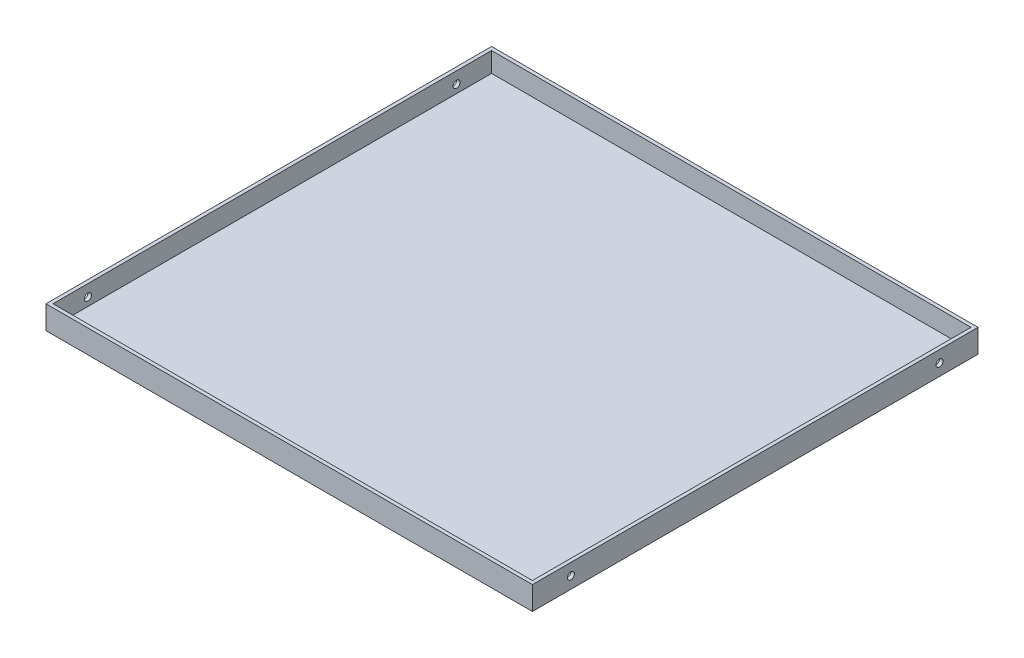
ISO-10303-21;
HEADER;
FILE_DESCRIPTION(('STEP AP214'),'2;1');
FILE_NAME('part.step','',(''),(''),'','','');
FILE_SCHEMA(('AUTOMOTIVE_DESIGN { 1 0 10303 214 1 1 1 1 }'));
ENDSEC;
DATA;
#1=APPLICATION_CONTEXT('core data for automotive mechanical design processes');
#2=APPLICATION_PROTOCOL_DEFINITION('international standard','automotive_design',2000,#1);
#3=PRODUCT_CONTEXT('',#1,'mechanical');
#4=PRODUCT('Part','Part','',(#3));
#5=PRODUCT_RELATED_PRODUCT_CATEGORY('part','',(#4));
#6=PRODUCT_DEFINITION_FORMATION('','',#4);
#7=PRODUCT_DEFINITION_CONTEXT('part definition',#1,'design');
#8=PRODUCT_DEFINITION('design','',#6,#7);
#9=PRODUCT_DEFINITION_SHAPE('','',#8);
#10=(LENGTH_UNIT() NAMED_UNIT(*) SI_UNIT(.MILLI.,.METRE.));
#11=(NAMED_UNIT(*) PLANE_ANGLE_UNIT() SI_UNIT($,.RADIAN.));
#12=(NAMED_UNIT(*) SI_UNIT($,.STERADIAN.) SOLID_ANGLE_UNIT());
#13=UNCERTAINTY_MEASURE_WITH_UNIT(LENGTH_MEASURE(1.E-05),#10,'distance_accuracy_value','');
#14=(GEOMETRIC_REPRESENTATION_CONTEXT(3) GLOBAL_UNCERTAINTY_ASSIGNED_CONTEXT((#13)) GLOBAL_UNIT_ASSIGNED_CONTEXT((#10,
#11,#12)) REPRESENTATION_CONTEXT('',''));
#15=CARTESIAN_POINT('',(0.,0.,0.));
#16=DIRECTION('',(0.,0.,1.));
#17=DIRECTION('',(1.,0.,0.));
#18=AXIS2_PLACEMENT_3D('',#15,#16,#17);
#19=CARTESIAN_POINT('',(417.,20.,0.));
#20=DIRECTION('',(0.,0.,1.));
#21=DIRECTION('',(1.,0.,0.));
#22=AXIS2_PLACEMENT_3D('',#19,#20,#21);
#23=PLANE('',#22);
#24=DIRECTION('',(-1.,0.,0.));
#25=VECTOR('',#24,1.);
#26=CARTESIAN_POINT('',(417.,0.,0.));
#27=LINE('',#26,#25);
#28=CARTESIAN_POINT('',(417.,0.,0.));
#29=VERTEX_POINT('',#28);
#30=CARTESIAN_POINT('',(0.,0.,0.));
#31=VERTEX_POINT('',#30);
#32=EDGE_CURVE('E163',#29,#31,#27,.T.);
#33=ORIENTED_EDGE('',*,*,#32,.T.);
#34=DIRECTION('',(0.,-1.,0.));
#35=VECTOR('',#34,1.);
#36=CARTESIAN_POINT('',(0.,20.,0.));
#37=LINE('',#36,#35);
#38=CARTESIAN_POINT('',(0.,20.,0.));
#39=VERTEX_POINT('',#38);
#40=EDGE_CURVE('E11',#39,#31,#37,.T.);
#41=ORIENTED_EDGE('',*,*,#40,.F.);
#42=DIRECTION('',(-1.,0.,0.));
#43=VECTOR('',#42,1.);
#44=CARTESIAN_POINT('',(417.,20.,0.));
#45=LINE('',#44,#43);
#46=CARTESIAN_POINT('',(417.,20.,0.));
#47=VERTEX_POINT('',#46);
#48=EDGE_CURVE('E169',#47,#39,#45,.T.);
#49=ORIENTED_EDGE('',*,*,#48,.F.);
#50=DIRECTION('',(0.,-1.,0.));
#51=VECTOR('',#50,1.);
#52=CARTESIAN_POINT('',(417.,20.,0.));
#53=LINE('',#52,#51);
#54=EDGE_CURVE('E179',#47,#29,#53,.T.);
#55=ORIENTED_EDGE('',*,*,#54,.T.);
#56=EDGE_LOOP('',(#33,#41,#49,#55));
#57=FACE_BOUND('',#56,.T.);
#58=ADVANCED_FACE('F39',(#57),#23,.F.);
#59=CARTESIAN_POINT('',(0.,20.,0.));
#60=DIRECTION('',(1.,0.,0.));
#61=DIRECTION('',(0.,0.,-1.));
#62=AXIS2_PLACEMENT_3D('',#59,#60,#61);
#63=PLANE('',#62);
#64=CARTESIAN_POINT('',(0.,10.,33.));
#65=DIRECTION('',(1.,0.,0.));
#66=DIRECTION('',(0.,0.,-1.));
#67=AXIS2_PLACEMENT_3D('',#64,#65,#66);
#68=CIRCLE('',#67,3.);
#69=CARTESIAN_POINT('',(0.,10.,30.));
#70=VERTEX_POINT('',#69);
#71=EDGE_CURVE('E202',#70,#70,#68,.T.);
#72=ORIENTED_EDGE('',*,*,#71,.T.);
#73=EDGE_LOOP('',(#72));
#74=FACE_BOUND('',#73,.T.);
#75=CARTESIAN_POINT('',(0.,10.,349.));
#76=DIRECTION('',(1.,0.,0.));
#77=DIRECTION('',(0.,0.,-1.));
#78=AXIS2_PLACEMENT_3D('',#75,#76,#77);
#79=CIRCLE('',#78,2.99999999999999);
#80=CARTESIAN_POINT('',(0.,10.,346.));
#81=VERTEX_POINT('',#80);
#82=EDGE_CURVE('E215',#81,#81,#79,.T.);
#83=ORIENTED_EDGE('',*,*,#82,.T.);
#84=EDGE_LOOP('',(#83));
#85=FACE_BOUND('',#84,.T.);
#86=DIRECTION('',(0.,0.,1.));
#87=VECTOR('',#86,1.);
#88=CARTESIAN_POINT('',(0.,0.,0.));
#89=LINE('',#88,#87);
#90=CARTESIAN_POINT('',(0.,0.,382.));
#91=VERTEX_POINT('',#90);
#92=EDGE_CURVE('E183',#31,#91,#89,.T.);
#93=ORIENTED_EDGE('',*,*,#92,.T.);
#94=DIRECTION('',(0.,-1.,0.));
#95=VECTOR('',#94,1.);
#96=CARTESIAN_POINT('',(0.,20.,382.));
#97=LINE('',#96,#95);
#98=CARTESIAN_POINT('',(0.,20.,382.));
#99=VERTEX_POINT('',#98);
#100=EDGE_CURVE('E48',#99,#91,#97,.T.);
#101=ORIENTED_EDGE('',*,*,#100,.F.);
#102=DIRECTION('',(0.,0.,1.));
#103=VECTOR('',#102,1.);
#104=CARTESIAN_POINT('',(0.,20.,0.));
#105=LINE('',#104,#103);
#106=EDGE_CURVE('E93',#39,#99,#105,.T.);
#107=ORIENTED_EDGE('',*,*,#106,.F.);
#108=ORIENTED_EDGE('',*,*,#40,.T.);
#109=EDGE_LOOP('',(#93,#101,#107,#108));
#110=FACE_BOUND('',#109,.T.);
#111=ADVANCED_FACE('F242',(#74,#85,#110),#63,.F.);
#112=CARTESIAN_POINT('',(0.,20.,382.));
#113=DIRECTION('',(0.,0.,-1.));
#114=DIRECTION('',(-1.,0.,0.));
#115=AXIS2_PLACEMENT_3D('',#112,#113,#114);
#116=PLANE('',#115);
#117=DIRECTION('',(1.,0.,0.));
#118=VECTOR('',#117,1.);
#119=CARTESIAN_POINT('',(0.,0.,382.));
#120=LINE('',#119,#118);
#121=CARTESIAN_POINT('',(417.,0.,382.));
#122=VERTEX_POINT('',#121);
#123=EDGE_CURVE('E186',#91,#122,#120,.T.);
#124=ORIENTED_EDGE('',*,*,#123,.T.);
#125=DIRECTION('',(0.,-1.,0.));
#126=VECTOR('',#125,1.);
#127=CARTESIAN_POINT('',(417.,20.,382.));
#128=LINE('',#127,#126);
#129=CARTESIAN_POINT('',(417.,20.,382.));
#130=VERTEX_POINT('',#129);
#131=EDGE_CURVE('E193',#130,#122,#128,.T.);
#132=ORIENTED_EDGE('',*,*,#131,.F.);
#133=DIRECTION('',(1.,0.,0.));
#134=VECTOR('',#133,1.);
#135=CARTESIAN_POINT('',(0.,20.,382.));
#136=LINE('',#135,#134);
#137=EDGE_CURVE('E174',#99,#130,#136,.T.);
#138=ORIENTED_EDGE('',*,*,#137,.F.);
#139=ORIENTED_EDGE('',*,*,#100,.T.);
#140=EDGE_LOOP('',(#124,#132,#138,#139));
#141=FACE_BOUND('',#140,.T.);
#142=ADVANCED_FACE('F232',(#141),#116,.F.);
#143=CARTESIAN_POINT('',(417.,20.,382.));
#144=DIRECTION('',(-1.,0.,0.));
#145=DIRECTION('',(0.,0.,1.));
#146=AXIS2_PLACEMENT_3D('',#143,#144,#145);
#147=PLANE('',#146);
#148=CARTESIAN_POINT('',(417.,10.,33.));
#149=DIRECTION('',(1.,0.,0.));
#150=DIRECTION('',(0.,0.,-1.));
#151=AXIS2_PLACEMENT_3D('',#148,#149,#150);
#152=CIRCLE('',#151,3.);
#153=CARTESIAN_POINT('',(417.,10.,30.));
#154=VERTEX_POINT('',#153);
#155=EDGE_CURVE('E209',#154,#154,#152,.T.);
#156=ORIENTED_EDGE('',*,*,#155,.F.);
#157=EDGE_LOOP('',(#156));
#158=FACE_BOUND('',#157,.T.);
#159=CARTESIAN_POINT('',(417.,10.,349.));
#160=DIRECTION('',(1.,0.,0.));
#161=DIRECTION('',(0.,0.,-1.));
#162=AXIS2_PLACEMENT_3D('',#159,#160,#161);
#163=CIRCLE('',#162,2.99999999999999);
#164=CARTESIAN_POINT('',(417.,10.,346.));
#165=VERTEX_POINT('',#164);
#166=EDGE_CURVE('E221',#165,#165,#163,.T.);
#167=ORIENTED_EDGE('',*,*,#166,.F.);
#168=EDGE_LOOP('',(#167));
#169=FACE_BOUND('',#168,.T.);
#170=DIRECTION('',(0.,0.,-1.));
#171=VECTOR('',#170,1.);
#172=CARTESIAN_POINT('',(417.,0.,382.));
#173=LINE('',#172,#171);
#174=EDGE_CURVE('E86',#122,#29,#173,.T.);
#175=ORIENTED_EDGE('',*,*,#174,.T.);
#176=ORIENTED_EDGE('',*,*,#54,.F.);
#177=DIRECTION('',(0.,0.,-1.));
#178=VECTOR('',#177,1.);
#179=CARTESIAN_POINT('',(417.,20.,382.));
#180=LINE('',#179,#178);
#181=EDGE_CURVE('E65',#130,#47,#180,.T.);
#182=ORIENTED_EDGE('',*,*,#181,.F.);
#183=ORIENTED_EDGE('',*,*,#131,.T.);
#184=EDGE_LOOP('',(#175,#176,#182,#183));
#185=FACE_BOUND('',#184,.T.);
#186=ADVANCED_FACE('F229',(#158,#169,#185),#147,.F.);
#187=CARTESIAN_POINT('',(0.,20.,0.));
#188=DIRECTION('',(0.,1.,0.));
#189=DIRECTION('',(0.,0.,1.));
#190=AXIS2_PLACEMENT_3D('',#187,#188,#189);
#191=PLANE('',#190);
#192=DIRECTION('',(0.,0.,1.));
#193=VECTOR('',#192,1.);
#194=CARTESIAN_POINT('',(3.,20.,3.));
#195=LINE('',#194,#193);
#196=CARTESIAN_POINT('',(3.,20.,3.));
#197=VERTEX_POINT('',#196);
#198=CARTESIAN_POINT('',(3.00000000000005,20.,379.));
#199=VERTEX_POINT('',#198);
#200=EDGE_CURVE('E56',#197,#199,#195,.T.);
#201=ORIENTED_EDGE('',*,*,#200,.F.);
#202=DIRECTION('',(-1.,0.,0.));
#203=VECTOR('',#202,1.);
#204=CARTESIAN_POINT('',(414.,20.,3.));
#205=LINE('',#204,#203);
#206=CARTESIAN_POINT('',(414.,20.,3.));
#207=VERTEX_POINT('',#206);
#208=EDGE_CURVE('E138',#207,#197,#205,.T.);
#209=ORIENTED_EDGE('',*,*,#208,.F.);
#210=DIRECTION('',(0.,0.,-1.));
#211=VECTOR('',#210,1.);
#212=CARTESIAN_POINT('',(414.,20.,379.));
#213=LINE('',#212,#211);
#214=CARTESIAN_POINT('',(414.,20.,379.));
#215=VERTEX_POINT('',#214);
#216=EDGE_CURVE('E142',#215,#207,#213,.T.);
#217=ORIENTED_EDGE('',*,*,#216,.F.);
#218=DIRECTION('',(1.,0.,0.));
#219=VECTOR('',#218,1.);
#220=CARTESIAN_POINT('',(3.00000000000005,20.,379.));
#221=LINE('',#220,#219);
#222=EDGE_CURVE('E154',#199,#215,#221,.T.);
#223=ORIENTED_EDGE('',*,*,#222,.F.);
#224=EDGE_LOOP('',(#201,#209,#217,#223));
#225=FACE_BOUND('',#224,.T.);
#226=ORIENTED_EDGE('',*,*,#48,.T.);
#227=ORIENTED_EDGE('',*,*,#106,.T.);
#228=ORIENTED_EDGE('',*,*,#137,.T.);
#229=ORIENTED_EDGE('',*,*,#181,.T.);
#230=EDGE_LOOP('',(#226,#227,#228,#229));
#231=FACE_BOUND('',#230,.T.);
#232=ADVANCED_FACE('F231',(#225,#231),#191,.T.);
#233=CARTESIAN_POINT('',(0.,0.,0.));
#234=DIRECTION('',(0.,1.,0.));
#235=DIRECTION('',(0.,0.,1.));
#236=AXIS2_PLACEMENT_3D('',#233,#234,#235);
#237=PLANE('',#236);
#238=ORIENTED_EDGE('',*,*,#32,.F.);
#239=ORIENTED_EDGE('',*,*,#174,.F.);
#240=ORIENTED_EDGE('',*,*,#123,.F.);
#241=ORIENTED_EDGE('',*,*,#92,.F.);
#242=EDGE_LOOP('',(#238,#239,#240,#241));
#243=FACE_BOUND('',#242,.T.);
#244=ADVANCED_FACE('F239',(#243),#237,.F.);
#245=CARTESIAN_POINT('',(3.,3.,3.));
#246=DIRECTION('',(-1.,0.,0.));
#247=DIRECTION('',(0.,0.,1.));
#248=AXIS2_PLACEMENT_3D('',#245,#246,#247);
#249=PLANE('',#248);
#250=CARTESIAN_POINT('',(3.,10.,33.));
#251=DIRECTION('',(-1.,0.,0.));
#252=DIRECTION('',(0.,0.,1.));
#253=AXIS2_PLACEMENT_3D('',#250,#251,#252);
#254=CIRCLE('',#253,3.);
#255=CARTESIAN_POINT('',(3.,10.,36.));
#256=VERTEX_POINT('',#255);
#257=EDGE_CURVE('E145',#256,#256,#254,.T.);
#258=ORIENTED_EDGE('',*,*,#257,.T.);
#259=EDGE_LOOP('',(#258));
#260=FACE_BOUND('',#259,.T.);
#261=CARTESIAN_POINT('',(3.00000000000004,10.,349.));
#262=DIRECTION('',(-1.,0.,0.));
#263=DIRECTION('',(0.,0.,1.));
#264=AXIS2_PLACEMENT_3D('',#261,#262,#263);
#265=CIRCLE('',#264,2.99999999999999);
#266=CARTESIAN_POINT('',(3.00000000000004,10.,352.));
#267=VERTEX_POINT('',#266);
#268=EDGE_CURVE('E201',#267,#267,#265,.T.);
#269=ORIENTED_EDGE('',*,*,#268,.T.);
#270=EDGE_LOOP('',(#269));
#271=FACE_BOUND('',#270,.T.);
#272=ORIENTED_EDGE('',*,*,#200,.T.);
#273=DIRECTION('',(0.,1.,0.));
#274=VECTOR('',#273,1.);
#275=CARTESIAN_POINT('',(3.00000000000005,3.,379.));
#276=LINE('',#275,#274);
#277=CARTESIAN_POINT('',(3.00000000000005,3.,379.));
#278=VERTEX_POINT('',#277);
#279=EDGE_CURVE('E113',#278,#199,#276,.T.);
#280=ORIENTED_EDGE('',*,*,#279,.F.);
#281=DIRECTION('',(0.,0.,1.));
#282=VECTOR('',#281,1.);
#283=CARTESIAN_POINT('',(3.,3.,3.));
#284=LINE('',#283,#282);
#285=CARTESIAN_POINT('',(3.,3.,3.));
#286=VERTEX_POINT('',#285);
#287=EDGE_CURVE('E117',#286,#278,#284,.T.);
#288=ORIENTED_EDGE('',*,*,#287,.F.);
#289=DIRECTION('',(0.,1.,0.));
#290=VECTOR('',#289,1.);
#291=CARTESIAN_POINT('',(3.,3.,3.));
#292=LINE('',#291,#290);
#293=EDGE_CURVE('E160',#286,#197,#292,.T.);
#294=ORIENTED_EDGE('',*,*,#293,.T.);
#295=EDGE_LOOP('',(#272,#280,#288,#294));
#296=FACE_BOUND('',#295,.T.);
#297=ADVANCED_FACE('F115',(#260,#271,#296),#249,.F.);
#298=CARTESIAN_POINT('',(414.,3.,3.));
#299=DIRECTION('',(0.,0.,-1.));
#300=DIRECTION('',(-1.,0.,0.));
#301=AXIS2_PLACEMENT_3D('',#298,#299,#300);
#302=PLANE('',#301);
#303=ORIENTED_EDGE('',*,*,#208,.T.);
#304=ORIENTED_EDGE('',*,*,#293,.F.);
#305=DIRECTION('',(-1.,0.,0.));
#306=VECTOR('',#305,1.);
#307=CARTESIAN_POINT('',(414.,3.,3.));
#308=LINE('',#307,#306);
#309=CARTESIAN_POINT('',(414.,3.,3.));
#310=VERTEX_POINT('',#309);
#311=EDGE_CURVE('E124',#310,#286,#308,.T.);
#312=ORIENTED_EDGE('',*,*,#311,.F.);
#313=DIRECTION('',(0.,1.,0.));
#314=VECTOR('',#313,1.);
#315=CARTESIAN_POINT('',(414.,3.,3.));
#316=LINE('',#315,#314);
#317=EDGE_CURVE('E164',#310,#207,#316,.T.);
#318=ORIENTED_EDGE('',*,*,#317,.T.);
#319=EDGE_LOOP('',(#303,#304,#312,#318));
#320=FACE_BOUND('',#319,.T.);
#321=ADVANCED_FACE('F263',(#320),#302,.F.);
#322=CARTESIAN_POINT('',(414.,3.,379.));
#323=DIRECTION('',(1.,0.,0.));
#324=DIRECTION('',(0.,0.,-1.));
#325=AXIS2_PLACEMENT_3D('',#322,#323,#324);
#326=PLANE('',#325);
#327=CARTESIAN_POINT('',(414.,10.,33.));
#328=DIRECTION('',(1.,0.,0.));
#329=DIRECTION('',(0.,0.,-1.));
#330=AXIS2_PLACEMENT_3D('',#327,#328,#329);
#331=CIRCLE('',#330,3.);
#332=CARTESIAN_POINT('',(414.,10.,30.));
#333=VERTEX_POINT('',#332);
#334=EDGE_CURVE('E42',#333,#333,#331,.T.);
#335=ORIENTED_EDGE('',*,*,#334,.T.);
#336=EDGE_LOOP('',(#335));
#337=FACE_BOUND('',#336,.T.);
#338=CARTESIAN_POINT('',(414.,10.,349.));
#339=DIRECTION('',(1.,0.,0.));
#340=DIRECTION('',(0.,0.,-1.));
#341=AXIS2_PLACEMENT_3D('',#338,#339,#340);
#342=CIRCLE('',#341,2.99999999999999);
#343=CARTESIAN_POINT('',(414.,10.,346.));
#344=VERTEX_POINT('',#343);
#345=EDGE_CURVE('E198',#344,#344,#342,.T.);
#346=ORIENTED_EDGE('',*,*,#345,.T.);
#347=EDGE_LOOP('',(#346));
#348=FACE_BOUND('',#347,.T.);
#349=ORIENTED_EDGE('',*,*,#216,.T.);
#350=ORIENTED_EDGE('',*,*,#317,.F.);
#351=DIRECTION('',(0.,0.,-1.));
#352=VECTOR('',#351,1.);
#353=CARTESIAN_POINT('',(414.,3.,379.));
#354=LINE('',#353,#352);
#355=CARTESIAN_POINT('',(414.,3.,379.));
#356=VERTEX_POINT('',#355);
#357=EDGE_CURVE('E133',#356,#310,#354,.T.);
#358=ORIENTED_EDGE('',*,*,#357,.F.);
#359=DIRECTION('',(0.,1.,0.));
#360=VECTOR('',#359,1.);
#361=CARTESIAN_POINT('',(414.,3.,379.));
#362=LINE('',#361,#360);
#363=EDGE_CURVE('E123',#356,#215,#362,.T.);
#364=ORIENTED_EDGE('',*,*,#363,.T.);
#365=EDGE_LOOP('',(#349,#350,#358,#364));
#366=FACE_BOUND('',#365,.T.);
#367=ADVANCED_FACE('F269',(#337,#348,#366),#326,.F.);
#368=CARTESIAN_POINT('',(3.00000000000005,3.,379.));
#369=DIRECTION('',(0.,0.,1.));
#370=DIRECTION('',(1.,0.,0.));
#371=AXIS2_PLACEMENT_3D('',#368,#369,#370);
#372=PLANE('',#371);
#373=ORIENTED_EDGE('',*,*,#222,.T.);
#374=ORIENTED_EDGE('',*,*,#363,.F.);
#375=DIRECTION('',(1.,0.,0.));
#376=VECTOR('',#375,1.);
#377=CARTESIAN_POINT('',(3.00000000000005,3.,379.));
#378=LINE('',#377,#376);
#379=EDGE_CURVE('E127',#278,#356,#378,.T.);
#380=ORIENTED_EDGE('',*,*,#379,.F.);
#381=ORIENTED_EDGE('',*,*,#279,.T.);
#382=EDGE_LOOP('',(#373,#374,#380,#381));
#383=FACE_BOUND('',#382,.T.);
#384=ADVANCED_FACE('F128',(#383),#372,.F.);
#385=CARTESIAN_POINT('',(0.,3.,0.));
#386=DIRECTION('',(0.,1.,0.));
#387=DIRECTION('',(0.,0.,1.));
#388=AXIS2_PLACEMENT_3D('',#385,#386,#387);
#389=PLANE('',#388);
#390=ORIENTED_EDGE('',*,*,#287,.T.);
#391=ORIENTED_EDGE('',*,*,#379,.T.);
#392=ORIENTED_EDGE('',*,*,#357,.T.);
#393=ORIENTED_EDGE('',*,*,#311,.T.);
#394=EDGE_LOOP('',(#390,#391,#392,#393));
#395=FACE_BOUND('',#394,.T.);
#396=ADVANCED_FACE('F135',(#395),#389,.T.);
#397=CARTESIAN_POINT('',(0.,10.,349.));
#398=DIRECTION('',(1.,0.,0.));
#399=DIRECTION('',(0.,0.,-1.));
#400=AXIS2_PLACEMENT_3D('',#397,#398,#399);
#401=CYLINDRICAL_SURFACE('',#400,2.99999999999999);
#402=ORIENTED_EDGE('',*,*,#166,.T.);
#403=EDGE_LOOP('',(#402));
#404=FACE_BOUND('',#403,.T.);
#405=ORIENTED_EDGE('',*,*,#345,.F.);
#406=EDGE_LOOP('',(#405));
#407=FACE_BOUND('',#406,.T.);
#408=ADVANCED_FACE('F226',(#404,#407),#401,.F.);
#409=CARTESIAN_POINT('',(0.,10.,33.));
#410=DIRECTION('',(1.,0.,0.));
#411=DIRECTION('',(0.,0.,-1.));
#412=AXIS2_PLACEMENT_3D('',#409,#410,#411);
#413=CYLINDRICAL_SURFACE('',#412,3.);
#414=ORIENTED_EDGE('',*,*,#155,.T.);
#415=EDGE_LOOP('',(#414));
#416=FACE_BOUND('',#415,.T.);
#417=ORIENTED_EDGE('',*,*,#334,.F.);
#418=EDGE_LOOP('',(#417));
#419=FACE_BOUND('',#418,.T.);
#420=ADVANCED_FACE('F282',(#416,#419),#413,.F.);
#421=ORIENTED_EDGE('',*,*,#82,.F.);
#422=EDGE_LOOP('',(#421));
#423=FACE_BOUND('',#422,.T.);
#424=ORIENTED_EDGE('',*,*,#268,.F.);
#425=EDGE_LOOP('',(#424));
#426=FACE_BOUND('',#425,.T.);
#427=ADVANCED_FACE('F278',(#423,#426),#401,.F.);
#428=ORIENTED_EDGE('',*,*,#71,.F.);
#429=EDGE_LOOP('',(#428));
#430=FACE_BOUND('',#429,.T.);
#431=ORIENTED_EDGE('',*,*,#257,.F.);
#432=EDGE_LOOP('',(#431));
#433=FACE_BOUND('',#432,.T.);
#434=ADVANCED_FACE('F281',(#430,#433),#413,.F.);
#435=CLOSED_SHELL('',(#58,#111,#142,#186,#232,#244,#297,#321,#367,#384,#396,#408,#420,#427,#434));
#436=MANIFOLD_SOLID_BREP('B2',#435);
#437=ADVANCED_BREP_SHAPE_REPRESENTATION('',(#18,#436),#14);
#438=SHAPE_DEFINITION_REPRESENTATION(#9,#437);
ENDSEC;
END-ISO-10303-21;
